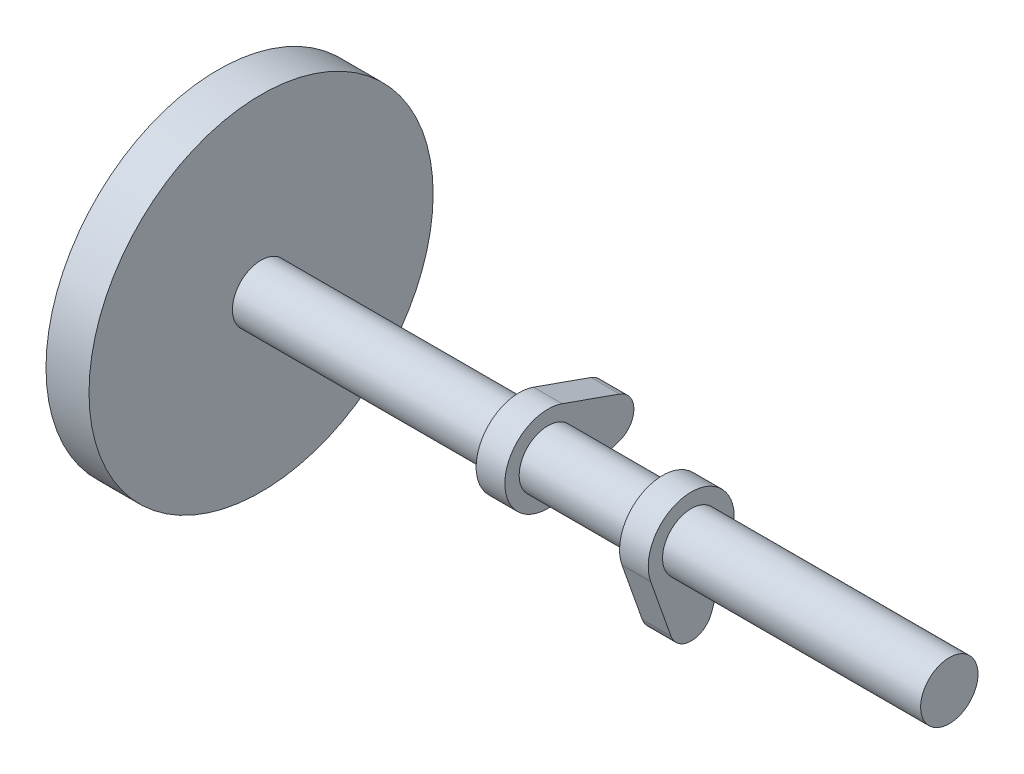
ISO-10303-21;
HEADER;
FILE_DESCRIPTION(('STEP AP214'),'2;1');
FILE_NAME('part.step','',(''),(''),'','','');
FILE_SCHEMA(('AUTOMOTIVE_DESIGN { 1 0 10303 214 1 1 1 1 }'));
ENDSEC;
DATA;
#1=APPLICATION_CONTEXT('core data for automotive mechanical design processes');
#2=APPLICATION_PROTOCOL_DEFINITION('international standard','automotive_design',2000,#1);
#3=PRODUCT_CONTEXT('',#1,'mechanical');
#4=PRODUCT('Part','Part','',(#3));
#5=PRODUCT_RELATED_PRODUCT_CATEGORY('part','',(#4));
#6=PRODUCT_DEFINITION_FORMATION('','',#4);
#7=PRODUCT_DEFINITION_CONTEXT('part definition',#1,'design');
#8=PRODUCT_DEFINITION('design','',#6,#7);
#9=PRODUCT_DEFINITION_SHAPE('','',#8);
#10=(LENGTH_UNIT() NAMED_UNIT(*) SI_UNIT(.MILLI.,.METRE.));
#11=(NAMED_UNIT(*) PLANE_ANGLE_UNIT() SI_UNIT($,.RADIAN.));
#12=(NAMED_UNIT(*) SI_UNIT($,.STERADIAN.) SOLID_ANGLE_UNIT());
#13=UNCERTAINTY_MEASURE_WITH_UNIT(LENGTH_MEASURE(1.E-05),#10,'distance_accuracy_value','');
#14=(GEOMETRIC_REPRESENTATION_CONTEXT(3) GLOBAL_UNCERTAINTY_ASSIGNED_CONTEXT((#13)) GLOBAL_UNIT_ASSIGNED_CONTEXT((#10,
#11,#12)) REPRESENTATION_CONTEXT('',''));
#15=CARTESIAN_POINT('',(0.,0.,0.));
#16=DIRECTION('',(0.,0.,1.));
#17=DIRECTION('',(1.,0.,0.));
#18=AXIS2_PLACEMENT_3D('',#15,#16,#17);
#19=CARTESIAN_POINT('',(-135.,0.,0.));
#20=DIRECTION('',(1.,0.,0.));
#21=DIRECTION('',(0.,0.,-1.));
#22=AXIS2_PLACEMENT_3D('',#19,#20,#21);
#23=CYLINDRICAL_SURFACE('',#22,60.);
#24=CARTESIAN_POINT('',(-135.,0.,0.));
#25=DIRECTION('',(-1.,0.,0.));
#26=DIRECTION('',(0.,0.,1.));
#27=AXIS2_PLACEMENT_3D('',#24,#25,#26);
#28=CIRCLE('',#27,60.);
#29=CARTESIAN_POINT('',(-135.,0.,60.));
#30=VERTEX_POINT('',#29);
#31=EDGE_CURVE('E11',#30,#30,#28,.T.);
#32=ORIENTED_EDGE('',*,*,#31,.F.);
#33=EDGE_LOOP('',(#32));
#34=FACE_BOUND('',#33,.T.);
#35=CARTESIAN_POINT('',(-120.,0.,0.));
#36=DIRECTION('',(-1.,0.,0.));
#37=DIRECTION('',(0.,0.,1.));
#38=AXIS2_PLACEMENT_3D('',#35,#36,#37);
#39=CIRCLE('',#38,60.);
#40=CARTESIAN_POINT('',(-120.,0.,60.));
#41=VERTEX_POINT('',#40);
#42=EDGE_CURVE('E52',#41,#41,#39,.T.);
#43=ORIENTED_EDGE('',*,*,#42,.T.);
#44=EDGE_LOOP('',(#43));
#45=FACE_BOUND('',#44,.T.);
#46=ADVANCED_FACE('F49',(#34,#45),#23,.T.);
#47=CARTESIAN_POINT('',(-135.,0.,0.));
#48=DIRECTION('',(-1.,0.,0.));
#49=DIRECTION('',(0.,0.,1.));
#50=AXIS2_PLACEMENT_3D('',#47,#48,#49);
#51=PLANE('',#50);
#52=ORIENTED_EDGE('',*,*,#31,.T.);
#53=EDGE_LOOP('',(#52));
#54=FACE_BOUND('',#53,.T.);
#55=ADVANCED_FACE('F64',(#54),#51,.T.);
#56=CARTESIAN_POINT('',(-120.,0.,0.));
#57=DIRECTION('',(-1.,0.,0.));
#58=DIRECTION('',(0.,0.,1.));
#59=AXIS2_PLACEMENT_3D('',#56,#57,#58);
#60=PLANE('',#59);
#61=ORIENTED_EDGE('',*,*,#42,.F.);
#62=EDGE_LOOP('',(#61));
#63=FACE_BOUND('',#62,.T.);
#64=ADVANCED_FACE('F62',(#63),#60,.F.);
#65=CLOSED_SHELL('',(#46,#55,#64));
#66=MANIFOLD_SOLID_BREP('B2_NOT_SHOWN',#65);
#67=CARTESIAN_POINT('',(120.,0.,0.));
#68=DIRECTION('',(-1.,0.,0.));
#69=DIRECTION('',(0.,0.,1.));
#70=AXIS2_PLACEMENT_3D('',#67,#68,#69);
#71=CYLINDRICAL_SURFACE('',#70,10.);
#72=CARTESIAN_POINT('',(30.,0.,0.));
#73=DIRECTION('',(1.,0.,0.));
#74=DIRECTION('',(0.,0.,-1.));
#75=AXIS2_PLACEMENT_3D('',#72,#73,#74);
#76=CIRCLE('',#75,10.);
#77=CARTESIAN_POINT('',(30.,0.,-10.));
#78=VERTEX_POINT('',#77);
#79=EDGE_CURVE('E211',#78,#78,#76,.T.);
#80=ORIENTED_EDGE('',*,*,#79,.T.);
#81=EDGE_LOOP('',(#80));
#82=FACE_BOUND('',#81,.T.);
#83=CARTESIAN_POINT('',(120.,0.,0.));
#84=DIRECTION('',(1.,0.,0.));
#85=DIRECTION('',(0.,0.,-1.));
#86=AXIS2_PLACEMENT_3D('',#83,#84,#85);
#87=CIRCLE('',#86,10.);
#88=CARTESIAN_POINT('',(120.,0.,-10.));
#89=VERTEX_POINT('',#88);
#90=EDGE_CURVE('E224',#89,#89,#87,.T.);
#91=ORIENTED_EDGE('',*,*,#90,.F.);
#92=EDGE_LOOP('',(#91));
#93=FACE_BOUND('',#92,.T.);
#94=ADVANCED_FACE('F90',(#82,#93),#71,.T.);
#95=CARTESIAN_POINT('',(120.,0.,0.));
#96=DIRECTION('',(1.,0.,0.));
#97=DIRECTION('',(0.,0.,-1.));
#98=AXIS2_PLACEMENT_3D('',#95,#96,#97);
#99=PLANE('',#98);
#100=ORIENTED_EDGE('',*,*,#90,.T.);
#101=EDGE_LOOP('',(#100));
#102=FACE_BOUND('',#101,.T.);
#103=ADVANCED_FACE('F260',(#102),#99,.T.);
#104=CARTESIAN_POINT('',(30.,-5.,-14.142135623731));
#105=DIRECTION('',(0.,-0.333333333333333,-0.942809041582063));
#106=DIRECTION('',(0.,0.942809041582063,-0.333333333333333));
#107=AXIS2_PLACEMENT_3D('',#104,#105,#106);
#108=PLANE('',#107);
#109=DIRECTION('',(0.,-0.942809041582063,0.333333333333333));
#110=VECTOR('',#109,1.);
#111=CARTESIAN_POINT('',(20.,-5.,-14.142135623731));
#112=LINE('',#111,#110);
#113=CARTESIAN_POINT('',(20.,-5.,-14.142135623731));
#114=VERTEX_POINT('',#113);
#115=CARTESIAN_POINT('',(20.,-25.,-7.07106781186548));
#116=VERTEX_POINT('',#115);
#117=EDGE_CURVE('E184',#114,#116,#112,.T.);
#118=ORIENTED_EDGE('',*,*,#117,.F.);
#119=DIRECTION('',(-1.,0.,0.));
#120=VECTOR('',#119,1.);
#121=CARTESIAN_POINT('',(30.,-5.,-14.142135623731));
#122=LINE('',#121,#120);
#123=CARTESIAN_POINT('',(30.,-5.,-14.142135623731));
#124=VERTEX_POINT('',#123);
#125=EDGE_CURVE('E135',#124,#114,#122,.T.);
#126=ORIENTED_EDGE('',*,*,#125,.F.);
#127=DIRECTION('',(0.,-0.942809041582063,0.333333333333333));
#128=VECTOR('',#127,1.);
#129=CARTESIAN_POINT('',(30.,-5.,-14.142135623731));
#130=LINE('',#129,#128);
#131=CARTESIAN_POINT('',(30.,-25.,-7.07106781186548));
#132=VERTEX_POINT('',#131);
#133=EDGE_CURVE('E214',#124,#132,#130,.T.);
#134=ORIENTED_EDGE('',*,*,#133,.T.);
#135=DIRECTION('',(-1.,0.,0.));
#136=VECTOR('',#135,1.);
#137=CARTESIAN_POINT('',(30.,-25.,-7.07106781186548));
#138=LINE('',#137,#136);
#139=EDGE_CURVE('E132',#132,#116,#138,.T.);
#140=ORIENTED_EDGE('',*,*,#139,.T.);
#141=EDGE_LOOP('',(#118,#126,#134,#140));
#142=FACE_BOUND('',#141,.T.);
#143=ADVANCED_FACE('F265',(#142),#108,.T.);
#144=CARTESIAN_POINT('',(30.,0.,0.));
#145=DIRECTION('',(-1.,0.,0.));
#146=DIRECTION('',(0.,0.,1.));
#147=AXIS2_PLACEMENT_3D('',#144,#145,#146);
#148=CYLINDRICAL_SURFACE('',#147,15.);
#149=CARTESIAN_POINT('',(20.,0.,0.));
#150=DIRECTION('',(1.,0.,0.));
#151=DIRECTION('',(0.,0.,-1.));
#152=AXIS2_PLACEMENT_3D('',#149,#150,#151);
#153=CIRCLE('',#152,15.);
#154=CARTESIAN_POINT('',(20.,-5.,14.142135623731));
#155=VERTEX_POINT('',#154);
#156=EDGE_CURVE('E226',#114,#155,#153,.T.);
#157=ORIENTED_EDGE('',*,*,#156,.T.);
#158=DIRECTION('',(-1.,0.,0.));
#159=VECTOR('',#158,1.);
#160=CARTESIAN_POINT('',(30.,-5.,14.142135623731));
#161=LINE('',#160,#159);
#162=CARTESIAN_POINT('',(30.,-5.,14.142135623731));
#163=VERTEX_POINT('',#162);
#164=EDGE_CURVE('E236',#163,#155,#161,.T.);
#165=ORIENTED_EDGE('',*,*,#164,.F.);
#166=CARTESIAN_POINT('',(30.,0.,0.));
#167=DIRECTION('',(1.,0.,0.));
#168=DIRECTION('',(0.,0.,-1.));
#169=AXIS2_PLACEMENT_3D('',#166,#167,#168);
#170=CIRCLE('',#169,15.);
#171=EDGE_CURVE('E216',#124,#163,#170,.T.);
#172=ORIENTED_EDGE('',*,*,#171,.F.);
#173=ORIENTED_EDGE('',*,*,#125,.T.);
#174=EDGE_LOOP('',(#157,#165,#172,#173));
#175=FACE_BOUND('',#174,.T.);
#176=ADVANCED_FACE('F283',(#175),#148,.T.);
#177=CARTESIAN_POINT('',(30.,-5.,14.142135623731));
#178=DIRECTION('',(0.,0.333333333333333,-0.942809041582063));
#179=DIRECTION('',(0.,0.942809041582063,0.333333333333333));
#180=AXIS2_PLACEMENT_3D('',#177,#178,#179);
#181=PLANE('',#180);
#182=DIRECTION('',(0.,-0.942809041582063,-0.333333333333333));
#183=VECTOR('',#182,1.);
#184=CARTESIAN_POINT('',(20.,-5.,14.142135623731));
#185=LINE('',#184,#183);
#186=CARTESIAN_POINT('',(20.,-25.,7.07106781186547));
#187=VERTEX_POINT('',#186);
#188=EDGE_CURVE('E229',#155,#187,#185,.T.);
#189=ORIENTED_EDGE('',*,*,#188,.T.);
#190=DIRECTION('',(-1.,0.,0.));
#191=VECTOR('',#190,1.);
#192=CARTESIAN_POINT('',(30.,-25.,7.07106781186547));
#193=LINE('',#192,#191);
#194=CARTESIAN_POINT('',(30.,-25.,7.07106781186547));
#195=VERTEX_POINT('',#194);
#196=EDGE_CURVE('E234',#195,#187,#193,.T.);
#197=ORIENTED_EDGE('',*,*,#196,.F.);
#198=DIRECTION('',(0.,-0.942809041582063,-0.333333333333333));
#199=VECTOR('',#198,1.);
#200=CARTESIAN_POINT('',(30.,-5.,14.142135623731));
#201=LINE('',#200,#199);
#202=EDGE_CURVE('E219',#163,#195,#201,.T.);
#203=ORIENTED_EDGE('',*,*,#202,.F.);
#204=ORIENTED_EDGE('',*,*,#164,.T.);
#205=EDGE_LOOP('',(#189,#197,#203,#204));
#206=FACE_BOUND('',#205,.T.);
#207=ADVANCED_FACE('F288',(#206),#181,.F.);
#208=CARTESIAN_POINT('',(30.,-22.5,0.));
#209=DIRECTION('',(-1.,0.,0.));
#210=DIRECTION('',(0.,0.,1.));
#211=AXIS2_PLACEMENT_3D('',#208,#209,#210);
#212=CYLINDRICAL_SURFACE('',#211,7.5);
#213=CARTESIAN_POINT('',(20.,-22.5,0.));
#214=DIRECTION('',(1.,0.,0.));
#215=DIRECTION('',(0.,0.,-1.));
#216=AXIS2_PLACEMENT_3D('',#213,#214,#215);
#217=CIRCLE('',#216,7.5);
#218=EDGE_CURVE('E125',#187,#116,#217,.T.);
#219=ORIENTED_EDGE('',*,*,#218,.T.);
#220=ORIENTED_EDGE('',*,*,#139,.F.);
#221=CARTESIAN_POINT('',(30.,-22.5,0.));
#222=DIRECTION('',(1.,0.,0.));
#223=DIRECTION('',(0.,0.,-1.));
#224=AXIS2_PLACEMENT_3D('',#221,#222,#223);
#225=CIRCLE('',#224,7.5);
#226=EDGE_CURVE('E108',#195,#132,#225,.T.);
#227=ORIENTED_EDGE('',*,*,#226,.F.);
#228=ORIENTED_EDGE('',*,*,#196,.T.);
#229=EDGE_LOOP('',(#219,#220,#227,#228));
#230=FACE_BOUND('',#229,.T.);
#231=ADVANCED_FACE('F294',(#230),#212,.T.);
#232=CARTESIAN_POINT('',(30.,0.,0.));
#233=DIRECTION('',(1.,0.,0.));
#234=DIRECTION('',(0.,0.,-1.));
#235=AXIS2_PLACEMENT_3D('',#232,#233,#234);
#236=PLANE('',#235);
#237=ORIENTED_EDGE('',*,*,#79,.F.);
#238=EDGE_LOOP('',(#237));
#239=FACE_BOUND('',#238,.T.);
#240=ORIENTED_EDGE('',*,*,#133,.F.);
#241=ORIENTED_EDGE('',*,*,#171,.T.);
#242=ORIENTED_EDGE('',*,*,#202,.T.);
#243=ORIENTED_EDGE('',*,*,#226,.T.);
#244=EDGE_LOOP('',(#240,#241,#242,#243));
#245=FACE_BOUND('',#244,.T.);
#246=ADVANCED_FACE('F275',(#239,#245),#236,.T.);
#247=CARTESIAN_POINT('',(20.,0.,0.));
#248=DIRECTION('',(1.,0.,0.));
#249=DIRECTION('',(0.,0.,-1.));
#250=AXIS2_PLACEMENT_3D('',#247,#248,#249);
#251=PLANE('',#250);
#252=CARTESIAN_POINT('',(20.,0.,0.));
#253=DIRECTION('',(1.,0.,0.));
#254=DIRECTION('',(0.,0.,-1.));
#255=AXIS2_PLACEMENT_3D('',#252,#253,#254);
#256=CIRCLE('',#255,10.);
#257=CARTESIAN_POINT('',(20.,0.,-10.));
#258=VERTEX_POINT('',#257);
#259=EDGE_CURVE('E99',#258,#258,#256,.T.);
#260=ORIENTED_EDGE('',*,*,#259,.T.);
#261=EDGE_LOOP('',(#260));
#262=FACE_BOUND('',#261,.T.);
#263=ORIENTED_EDGE('',*,*,#117,.T.);
#264=ORIENTED_EDGE('',*,*,#218,.F.);
#265=ORIENTED_EDGE('',*,*,#188,.F.);
#266=ORIENTED_EDGE('',*,*,#156,.F.);
#267=EDGE_LOOP('',(#263,#264,#265,#266));
#268=FACE_BOUND('',#267,.T.);
#269=ADVANCED_FACE('F268',(#262,#268),#251,.F.);
#270=CARTESIAN_POINT('',(-20.,0.,0.));
#271=DIRECTION('',(1.,0.,0.));
#272=DIRECTION('',(0.,1.,0.));
#273=AXIS2_PLACEMENT_3D('',#270,#271,#272);
#274=CIRCLE('',#273,10.);
#275=CARTESIAN_POINT('',(-20.,10.,-1.04744440165294E-13));
#276=VERTEX_POINT('',#275);
#277=EDGE_CURVE('E198',#276,#276,#274,.T.);
#278=ORIENTED_EDGE('',*,*,#277,.T.);
#279=EDGE_LOOP('',(#278));
#280=FACE_BOUND('',#279,.T.);
#281=ORIENTED_EDGE('',*,*,#259,.F.);
#282=EDGE_LOOP('',(#281));
#283=FACE_BOUND('',#282,.T.);
#284=ADVANCED_FACE('F255',(#280,#283),#71,.T.);
#285=CARTESIAN_POINT('',(-30.,14.1421356237309,-5.00000000000015));
#286=DIRECTION('',(0.,0.94280904158206,-0.333333333333343));
#287=DIRECTION('',(0.,0.333333333333343,0.94280904158206));
#288=AXIS2_PLACEMENT_3D('',#285,#286,#287);
#289=PLANE('',#288);
#290=DIRECTION('',(0.,-0.333333333333343,-0.94280904158206));
#291=VECTOR('',#290,1.);
#292=CARTESIAN_POINT('',(-20.,14.1421356237309,-5.00000000000015));
#293=LINE('',#292,#291);
#294=CARTESIAN_POINT('',(-20.,14.1421356237309,-5.00000000000015));
#295=VERTEX_POINT('',#294);
#296=CARTESIAN_POINT('',(-20.,7.07106781186521,-25.0000000000001));
#297=VERTEX_POINT('',#296);
#298=EDGE_CURVE('E201',#295,#297,#293,.T.);
#299=ORIENTED_EDGE('',*,*,#298,.T.);
#300=DIRECTION('',(1.,0.,0.));
#301=VECTOR('',#300,1.);
#302=CARTESIAN_POINT('',(-30.,7.07106781186521,-25.0000000000001));
#303=LINE('',#302,#301);
#304=CARTESIAN_POINT('',(-30.,7.07106781186521,-25.0000000000001));
#305=VERTEX_POINT('',#304);
#306=EDGE_CURVE('E189',#305,#297,#303,.T.);
#307=ORIENTED_EDGE('',*,*,#306,.F.);
#308=DIRECTION('',(0.,-0.333333333333343,-0.94280904158206));
#309=VECTOR('',#308,1.);
#310=CARTESIAN_POINT('',(-30.,14.1421356237309,-5.00000000000015));
#311=LINE('',#310,#309);
#312=CARTESIAN_POINT('',(-30.,14.1421356237309,-5.00000000000015));
#313=VERTEX_POINT('',#312);
#314=EDGE_CURVE('E168',#313,#305,#311,.T.);
#315=ORIENTED_EDGE('',*,*,#314,.F.);
#316=DIRECTION('',(1.,0.,0.));
#317=VECTOR('',#316,1.);
#318=CARTESIAN_POINT('',(-30.,14.1421356237309,-5.00000000000015));
#319=LINE('',#318,#317);
#320=EDGE_CURVE('E177',#313,#295,#319,.T.);
#321=ORIENTED_EDGE('',*,*,#320,.T.);
#322=EDGE_LOOP('',(#299,#307,#315,#321));
#323=FACE_BOUND('',#322,.T.);
#324=ADVANCED_FACE('F187',(#323),#289,.T.);
#325=CARTESIAN_POINT('',(-30.,0.,0.));
#326=DIRECTION('',(1.,0.,0.));
#327=DIRECTION('',(0.,-1.,0.));
#328=AXIS2_PLACEMENT_3D('',#325,#326,#327);
#329=CYLINDRICAL_SURFACE('',#328,15.);
#330=CARTESIAN_POINT('',(-20.,0.,0.));
#331=DIRECTION('',(1.,0.,0.));
#332=DIRECTION('',(0.,1.,0.));
#333=AXIS2_PLACEMENT_3D('',#330,#331,#332);
#334=CIRCLE('',#333,15.);
#335=CARTESIAN_POINT('',(-20.,-14.142135623731,-4.99999999999985));
#336=VERTEX_POINT('',#335);
#337=EDGE_CURVE('E180',#295,#336,#334,.T.);
#338=ORIENTED_EDGE('',*,*,#337,.F.);
#339=ORIENTED_EDGE('',*,*,#320,.F.);
#340=CARTESIAN_POINT('',(-30.,0.,0.));
#341=DIRECTION('',(1.,0.,0.));
#342=DIRECTION('',(0.,1.,0.));
#343=AXIS2_PLACEMENT_3D('',#340,#341,#342);
#344=CIRCLE('',#343,15.);
#345=CARTESIAN_POINT('',(-30.,-14.142135623731,-4.99999999999985));
#346=VERTEX_POINT('',#345);
#347=EDGE_CURVE('E164',#313,#346,#344,.T.);
#348=ORIENTED_EDGE('',*,*,#347,.T.);
#349=DIRECTION('',(1.,0.,0.));
#350=VECTOR('',#349,1.);
#351=CARTESIAN_POINT('',(-30.,-14.142135623731,-4.99999999999985));
#352=LINE('',#351,#350);
#353=EDGE_CURVE('E185',#346,#336,#352,.T.);
#354=ORIENTED_EDGE('',*,*,#353,.T.);
#355=EDGE_LOOP('',(#338,#339,#348,#354));
#356=FACE_BOUND('',#355,.T.);
#357=ADVANCED_FACE('F178',(#356),#329,.T.);
#358=CARTESIAN_POINT('',(-30.,-14.142135623731,-4.99999999999985));
#359=DIRECTION('',(0.,0.942809041582067,0.333333333333324));
#360=DIRECTION('',(0.,-0.333333333333324,0.942809041582067));
#361=AXIS2_PLACEMENT_3D('',#358,#359,#360);
#362=PLANE('',#361);
#363=DIRECTION('',(0.,0.333333333333324,-0.942809041582067));
#364=VECTOR('',#363,1.);
#365=CARTESIAN_POINT('',(-20.,-14.142135623731,-4.99999999999985));
#366=LINE('',#365,#364);
#367=CARTESIAN_POINT('',(-20.,-7.07106781186573,-24.9999999999999));
#368=VERTEX_POINT('',#367);
#369=EDGE_CURVE('E192',#336,#368,#366,.T.);
#370=ORIENTED_EDGE('',*,*,#369,.F.);
#371=ORIENTED_EDGE('',*,*,#353,.F.);
#372=DIRECTION('',(0.,0.333333333333324,-0.942809041582067));
#373=VECTOR('',#372,1.);
#374=CARTESIAN_POINT('',(-30.,-14.142135623731,-4.99999999999985));
#375=LINE('',#374,#373);
#376=CARTESIAN_POINT('',(-30.,-7.07106781186573,-24.9999999999999));
#377=VERTEX_POINT('',#376);
#378=EDGE_CURVE('E171',#346,#377,#375,.T.);
#379=ORIENTED_EDGE('',*,*,#378,.T.);
#380=DIRECTION('',(1.,0.,0.));
#381=VECTOR('',#380,1.);
#382=CARTESIAN_POINT('',(-30.,-7.07106781186573,-24.9999999999999));
#383=LINE('',#382,#381);
#384=EDGE_CURVE('E207',#377,#368,#383,.T.);
#385=ORIENTED_EDGE('',*,*,#384,.T.);
#386=EDGE_LOOP('',(#370,#371,#379,#385));
#387=FACE_BOUND('',#386,.T.);
#388=ADVANCED_FACE('F304',(#387),#362,.F.);
#389=CARTESIAN_POINT('',(-30.,-2.3291953507383E-13,-22.5));
#390=DIRECTION('',(1.,0.,0.));
#391=DIRECTION('',(0.,-1.,0.));
#392=AXIS2_PLACEMENT_3D('',#389,#390,#391);
#393=CYLINDRICAL_SURFACE('',#392,7.5);
#394=CARTESIAN_POINT('',(-20.,-2.3291953507383E-13,-22.5));
#395=DIRECTION('',(1.,0.,0.));
#396=DIRECTION('',(0.,1.,0.));
#397=AXIS2_PLACEMENT_3D('',#394,#395,#396);
#398=CIRCLE('',#397,7.5);
#399=EDGE_CURVE('E190',#368,#297,#398,.T.);
#400=ORIENTED_EDGE('',*,*,#399,.F.);
#401=ORIENTED_EDGE('',*,*,#384,.F.);
#402=CARTESIAN_POINT('',(-30.,-2.3291953507383E-13,-22.5));
#403=DIRECTION('',(1.,0.,0.));
#404=DIRECTION('',(0.,1.,0.));
#405=AXIS2_PLACEMENT_3D('',#402,#403,#404);
#406=CIRCLE('',#405,7.5);
#407=EDGE_CURVE('E196',#377,#305,#406,.T.);
#408=ORIENTED_EDGE('',*,*,#407,.T.);
#409=ORIENTED_EDGE('',*,*,#306,.T.);
#410=EDGE_LOOP('',(#400,#401,#408,#409));
#411=FACE_BOUND('',#410,.T.);
#412=ADVANCED_FACE('F307',(#411),#393,.T.);
#413=CARTESIAN_POINT('',(-30.,0.,0.));
#414=DIRECTION('',(-1.,0.,0.));
#415=DIRECTION('',(0.,1.,0.));
#416=AXIS2_PLACEMENT_3D('',#413,#414,#415);
#417=PLANE('',#416);
#418=CARTESIAN_POINT('',(-30.,0.,0.));
#419=DIRECTION('',(1.,0.,0.));
#420=DIRECTION('',(0.,1.,0.));
#421=AXIS2_PLACEMENT_3D('',#418,#419,#420);
#422=CIRCLE('',#421,10.);
#423=CARTESIAN_POINT('',(-30.,10.,-1.04744440165294E-13));
#424=VERTEX_POINT('',#423);
#425=EDGE_CURVE('E47',#424,#424,#422,.T.);
#426=ORIENTED_EDGE('',*,*,#425,.T.);
#427=EDGE_LOOP('',(#426));
#428=FACE_BOUND('',#427,.T.);
#429=ORIENTED_EDGE('',*,*,#314,.T.);
#430=ORIENTED_EDGE('',*,*,#407,.F.);
#431=ORIENTED_EDGE('',*,*,#378,.F.);
#432=ORIENTED_EDGE('',*,*,#347,.F.);
#433=EDGE_LOOP('',(#429,#430,#431,#432));
#434=FACE_BOUND('',#433,.T.);
#435=ADVANCED_FACE('F166',(#428,#434),#417,.T.);
#436=CARTESIAN_POINT('',(-20.,0.,0.));
#437=DIRECTION('',(-1.,0.,0.));
#438=DIRECTION('',(0.,1.,0.));
#439=AXIS2_PLACEMENT_3D('',#436,#437,#438);
#440=PLANE('',#439);
#441=ORIENTED_EDGE('',*,*,#277,.F.);
#442=EDGE_LOOP('',(#441));
#443=FACE_BOUND('',#442,.T.);
#444=ORIENTED_EDGE('',*,*,#298,.F.);
#445=ORIENTED_EDGE('',*,*,#337,.T.);
#446=ORIENTED_EDGE('',*,*,#369,.T.);
#447=ORIENTED_EDGE('',*,*,#399,.T.);
#448=EDGE_LOOP('',(#444,#445,#446,#447));
#449=FACE_BOUND('',#448,.T.);
#450=ADVANCED_FACE('F250',(#443,#449),#440,.F.);
#451=CARTESIAN_POINT('',(-120.,0.,0.));
#452=DIRECTION('',(1.,0.,0.));
#453=DIRECTION('',(0.,0.,-1.));
#454=AXIS2_PLACEMENT_3D('',#451,#452,#453);
#455=PLANE('',#454);
#456=CARTESIAN_POINT('',(-120.,0.,0.));
#457=DIRECTION('',(1.,0.,0.));
#458=DIRECTION('',(0.,0.,-1.));
#459=AXIS2_PLACEMENT_3D('',#456,#457,#458);
#460=CIRCLE('',#459,10.);
#461=CARTESIAN_POINT('',(-120.,0.,-10.));
#462=VERTEX_POINT('',#461);
#463=EDGE_CURVE('E93',#462,#462,#460,.T.);
#464=ORIENTED_EDGE('',*,*,#463,.F.);
#465=EDGE_LOOP('',(#464));
#466=FACE_BOUND('',#465,.T.);
#467=ADVANCED_FACE('F248',(#466),#455,.F.);
#468=ORIENTED_EDGE('',*,*,#463,.T.);
#469=EDGE_LOOP('',(#468));
#470=FACE_BOUND('',#469,.T.);
#471=ORIENTED_EDGE('',*,*,#425,.F.);
#472=EDGE_LOOP('',(#471));
#473=FACE_BOUND('',#472,.T.);
#474=ADVANCED_FACE('F245',(#470,#473),#71,.T.);
#475=CLOSED_SHELL('',(#94,#103,#143,#176,#207,#231,#246,#269,#284,#324,#357,#388,#412,#435,#450,
#467,#474));
#476=MANIFOLD_SOLID_BREP('B6',#475);
#477=ADVANCED_BREP_SHAPE_REPRESENTATION('',(#18,#66,#476),#14);
#478=SHAPE_DEFINITION_REPRESENTATION(#9,#477);
ENDSEC;
END-ISO-10303-21;
